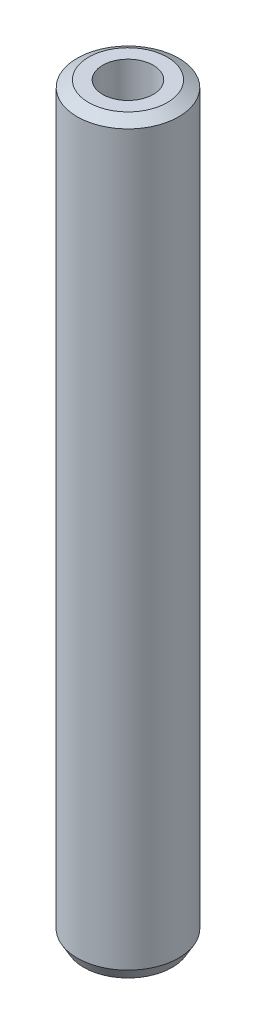
ISO-10303-21;
HEADER;
FILE_DESCRIPTION(('STEP AP214'),'2;1');
FILE_NAME('part.step','',(''),(''),'','','');
FILE_SCHEMA(('AUTOMOTIVE_DESIGN { 1 0 10303 214 1 1 1 1 }'));
ENDSEC;
DATA;
#1=APPLICATION_CONTEXT('core data for automotive mechanical design processes');
#2=APPLICATION_PROTOCOL_DEFINITION('international standard','automotive_design',2000,#1);
#3=PRODUCT_CONTEXT('',#1,'mechanical');
#4=PRODUCT('Part','Part','',(#3));
#5=PRODUCT_RELATED_PRODUCT_CATEGORY('part','',(#4));
#6=PRODUCT_DEFINITION_FORMATION('','',#4);
#7=PRODUCT_DEFINITION_CONTEXT('part definition',#1,'design');
#8=PRODUCT_DEFINITION('design','',#6,#7);
#9=PRODUCT_DEFINITION_SHAPE('','',#8);
#10=(LENGTH_UNIT() NAMED_UNIT(*) SI_UNIT(.MILLI.,.METRE.));
#11=(NAMED_UNIT(*) PLANE_ANGLE_UNIT() SI_UNIT($,.RADIAN.));
#12=(NAMED_UNIT(*) SI_UNIT($,.STERADIAN.) SOLID_ANGLE_UNIT());
#13=UNCERTAINTY_MEASURE_WITH_UNIT(LENGTH_MEASURE(1.E-05),#10,'distance_accuracy_value','');
#14=(GEOMETRIC_REPRESENTATION_CONTEXT(3) GLOBAL_UNCERTAINTY_ASSIGNED_CONTEXT((#13)) GLOBAL_UNIT_ASSIGNED_CONTEXT((#10,
#11,#12)) REPRESENTATION_CONTEXT('',''));
#15=CARTESIAN_POINT('',(0.,0.,0.));
#16=DIRECTION('',(0.,0.,1.));
#17=DIRECTION('',(1.,0.,0.));
#18=AXIS2_PLACEMENT_3D('',#15,#16,#17);
#19=CARTESIAN_POINT('',(0.,183.758441967485,0.));
#20=DIRECTION('',(0.,-1.,0.));
#21=DIRECTION('',(0.,0.,-1.));
#22=AXIS2_PLACEMENT_3D('',#19,#20,#21);
#23=CYLINDRICAL_SURFACE('',#22,12.5);
#24=CARTESIAN_POINT('',(0.,182.13114617367,0.));
#25=DIRECTION('',(0.,1.,0.));
#26=DIRECTION('',(0.,0.,1.));
#27=AXIS2_PLACEMENT_3D('',#24,#25,#26);
#28=CIRCLE('',#27,12.5);
#29=CARTESIAN_POINT('',(0.,182.13114617367,12.5));
#30=VERTEX_POINT('',#29);
#31=EDGE_CURVE('E50',#30,#30,#28,.F.);
#32=ORIENTED_EDGE('',*,*,#31,.T.);
#33=EDGE_LOOP('',(#32));
#34=FACE_BOUND('',#33,.T.);
#35=CARTESIAN_POINT('',(0.,2.81855899383082,0.));
#36=DIRECTION('',(0.,1.,0.));
#37=DIRECTION('',(0.,0.,1.));
#38=AXIS2_PLACEMENT_3D('',#35,#36,#37);
#39=CIRCLE('',#38,12.5);
#40=CARTESIAN_POINT('',(0.,2.81855899383082,12.5));
#41=VERTEX_POINT('',#40);
#42=EDGE_CURVE('E51',#41,#41,#39,.T.);
#43=ORIENTED_EDGE('',*,*,#42,.T.);
#44=EDGE_LOOP('',(#43));
#45=FACE_BOUND('',#44,.T.);
#46=ADVANCED_FACE('F39',(#34,#45),#23,.T.);
#47=CARTESIAN_POINT('',(0.,183.758441967485,0.));
#48=DIRECTION('',(0.,1.,0.));
#49=DIRECTION('',(0.,0.,1.));
#50=AXIS2_PLACEMENT_3D('',#47,#48,#49);
#51=PLANE('',#50);
#52=CARTESIAN_POINT('',(0.,183.758441967485,0.));
#53=DIRECTION('',(0.,1.,0.));
#54=DIRECTION('',(0.,0.,1.));
#55=AXIS2_PLACEMENT_3D('',#52,#53,#54);
#56=CIRCLE('',#55,9.68144100616913);
#57=CARTESIAN_POINT('',(0.,183.758441967485,9.68144100616913));
#58=VERTEX_POINT('',#57);
#59=EDGE_CURVE('E54',#58,#58,#56,.T.);
#60=ORIENTED_EDGE('',*,*,#59,.T.);
#61=EDGE_LOOP('',(#60));
#62=FACE_BOUND('',#61,.T.);
#63=CARTESIAN_POINT('',(0.,183.758441967485,0.));
#64=DIRECTION('',(0.,1.,0.));
#65=DIRECTION('',(0.,0.,1.));
#66=AXIS2_PLACEMENT_3D('',#63,#64,#65);
#67=CIRCLE('',#66,6.23207617805063);
#68=CARTESIAN_POINT('',(0.,183.758441967485,6.23207617805063));
#69=VERTEX_POINT('',#68);
#70=EDGE_CURVE('E58',#69,#69,#67,.T.);
#71=ORIENTED_EDGE('',*,*,#70,.F.);
#72=EDGE_LOOP('',(#71));
#73=FACE_BOUND('',#72,.T.);
#74=ADVANCED_FACE('F69',(#62,#73),#51,.T.);
#75=CARTESIAN_POINT('',(0.,0.,0.));
#76=DIRECTION('',(0.,1.,0.));
#77=DIRECTION('',(0.,0.,1.));
#78=AXIS2_PLACEMENT_3D('',#75,#76,#77);
#79=PLANE('',#78);
#80=CARTESIAN_POINT('',(0.,0.,0.));
#81=DIRECTION('',(0.,1.,0.));
#82=DIRECTION('',(0.,0.,1.));
#83=AXIS2_PLACEMENT_3D('',#80,#81,#82);
#84=CIRCLE('',#83,10.8727042061849);
#85=CARTESIAN_POINT('',(0.,0.,10.8727042061849));
#86=VERTEX_POINT('',#85);
#87=EDGE_CURVE('E10',#86,#86,#84,.F.);
#88=ORIENTED_EDGE('',*,*,#87,.T.);
#89=EDGE_LOOP('',(#88));
#90=FACE_BOUND('',#89,.T.);
#91=CARTESIAN_POINT('',(0.,0.,0.));
#92=DIRECTION('',(0.,1.,0.));
#93=DIRECTION('',(0.,0.,1.));
#94=AXIS2_PLACEMENT_3D('',#91,#92,#93);
#95=CIRCLE('',#94,6.23207617805063);
#96=CARTESIAN_POINT('',(0.,0.,6.23207617805063));
#97=VERTEX_POINT('',#96);
#98=EDGE_CURVE('E63',#97,#97,#95,.T.);
#99=ORIENTED_EDGE('',*,*,#98,.T.);
#100=EDGE_LOOP('',(#99));
#101=FACE_BOUND('',#100,.T.);
#102=ADVANCED_FACE('F75',(#90,#101),#79,.F.);
#103=CARTESIAN_POINT('',(0.,183.758441967485,0.));
#104=DIRECTION('',(0.,-1.,0.));
#105=DIRECTION('',(0.,0.,-1.));
#106=AXIS2_PLACEMENT_3D('',#103,#104,#105);
#107=CYLINDRICAL_SURFACE('',#106,6.23207617805063);
#108=ORIENTED_EDGE('',*,*,#70,.T.);
#109=EDGE_LOOP('',(#108));
#110=FACE_BOUND('',#109,.T.);
#111=ORIENTED_EDGE('',*,*,#98,.F.);
#112=EDGE_LOOP('',(#111));
#113=FACE_BOUND('',#112,.T.);
#114=ADVANCED_FACE('F70',(#110,#113),#107,.F.);
#115=CARTESIAN_POINT('',(0.,183.758441967485,0.));
#116=DIRECTION('',(0.,-1.,0.));
#117=DIRECTION('',(0.,0.,-1.));
#118=AXIS2_PLACEMENT_3D('',#115,#116,#117);
#119=CONICAL_SURFACE('',#118,9.68144100616913,1.0471975511966);
#120=ORIENTED_EDGE('',*,*,#31,.F.);
#121=EDGE_LOOP('',(#120));
#122=FACE_BOUND('',#121,.T.);
#123=ORIENTED_EDGE('',*,*,#59,.F.);
#124=EDGE_LOOP('',(#123));
#125=FACE_BOUND('',#124,.T.);
#126=ADVANCED_FACE('F81',(#122,#125),#119,.T.);
#127=CARTESIAN_POINT('',(0.,2.81855899383082,0.));
#128=DIRECTION('',(0.,1.,0.));
#129=DIRECTION('',(0.,0.,1.));
#130=AXIS2_PLACEMENT_3D('',#127,#128,#129);
#131=CONICAL_SURFACE('',#130,12.5,0.523598775598305);
#132=CARTESIAN_POINT('',(0.,0.,10.8727042061849));
#133=CARTESIAN_POINT('',(0.,0.0293599895190702,10.8896552040372));
#134=CARTESIAN_POINT('',(0.,0.0587199790381414,10.9066062018894));
#135=CARTESIAN_POINT('',(0.,0.117439958076284,10.9405081975939));
#136=CARTESIAN_POINT('',(0.,0.146799947595355,10.9574591954461));
#137=CARTESIAN_POINT('',(0.,0.205519926633497,10.9913611911506));
#138=CARTESIAN_POINT('',(0.,0.234879916152568,11.0083121890028));
#139=CARTESIAN_POINT('',(0.,0.29359989519071,11.0422141847073));
#140=CARTESIAN_POINT('',(0.,0.322959884709781,11.0591651825596));
#141=CARTESIAN_POINT('',(0.,0.381679863747923,11.093067178264));
#142=CARTESIAN_POINT('',(0.,0.411039853266994,11.1100181761163));
#143=CARTESIAN_POINT('',(0.,0.469759832305137,11.1439201718208));
#144=CARTESIAN_POINT('',(0.,0.499119821824208,11.160871169673));
#145=CARTESIAN_POINT('',(0.,0.55783980086235,11.1947731653775));
#146=CARTESIAN_POINT('',(0.,0.587199790381421,11.2117241632297));
#147=CARTESIAN_POINT('',(0.,0.645919769419563,11.2456261589342));
#148=CARTESIAN_POINT('',(0.,0.675279758938634,11.2625771567864));
#149=CARTESIAN_POINT('',(0.,0.733999737976776,11.2964791524909));
#150=CARTESIAN_POINT('',(0.,0.763359727495847,11.3134301503432));
#151=CARTESIAN_POINT('',(0.,0.822079706533989,11.3473321460476));
#152=CARTESIAN_POINT('',(0.,0.85143969605306,11.3642831438999));
#153=CARTESIAN_POINT('',(0.,0.910159675091202,11.3981851396044));
#154=CARTESIAN_POINT('',(0.,0.939519664610273,11.4151361374566));
#155=CARTESIAN_POINT('',(0.,0.998239643648416,11.4490381331611));
#156=CARTESIAN_POINT('',(0.,1.02759963316749,11.4659891310133));
#157=CARTESIAN_POINT('',(0.,1.08631961220563,11.4998911267178));
#158=CARTESIAN_POINT('',(0.,1.1156796017247,11.5168421245701));
#159=CARTESIAN_POINT('',(0.,1.17439958076284,11.5507441202745));
#160=CARTESIAN_POINT('',(0.,1.20375957028191,11.5676951181268));
#161=CARTESIAN_POINT('',(0.,1.26247954932006,11.6015971138313));
#162=CARTESIAN_POINT('',(0.,1.29183953883913,11.6185481116835));
#163=CARTESIAN_POINT('',(0.,1.35055951787727,11.652450107388));
#164=CARTESIAN_POINT('',(0.,1.37991950739634,11.6694011052402));
#165=CARTESIAN_POINT('',(0.,1.43863948643448,11.7033031009447));
#166=CARTESIAN_POINT('',(0.,1.46799947595355,11.7202540987969));
#167=CARTESIAN_POINT('',(0.,1.52671945499169,11.7541560945014));
#168=CARTESIAN_POINT('',(0.,1.55607944451077,11.7711070923537));
#169=CARTESIAN_POINT('',(0.,1.61479942354891,11.8050090880581));
#170=CARTESIAN_POINT('',(0.,1.64415941306798,11.8219600859104));
#171=CARTESIAN_POINT('',(0.,1.70287939210612,11.8558620816149));
#172=CARTESIAN_POINT('',(0.,1.73223938162519,11.8728130794671));
#173=CARTESIAN_POINT('',(0.,1.79095936066333,11.9067150751716));
#174=CARTESIAN_POINT('',(0.,1.82031935018241,11.9236660730238));
#175=CARTESIAN_POINT('',(0.,1.87903932922055,11.9575680687283));
#176=CARTESIAN_POINT('',(0.,1.90839931873962,11.9745190665805));
#177=CARTESIAN_POINT('',(0.,1.96711929777776,12.008421062285));
#178=CARTESIAN_POINT('',(0.,1.99647928729683,12.0253720601373));
#179=CARTESIAN_POINT('',(0.,2.05519926633497,12.0592740558417));
#180=CARTESIAN_POINT('',(0.,2.08455925585405,12.076225053694));
#181=CARTESIAN_POINT('',(0.,2.14327923489219,12.1101270493985));
#182=CARTESIAN_POINT('',(0.,2.17263922441126,12.1270780472507));
#183=CARTESIAN_POINT('',(0.,2.2313592034494,12.1609800429552));
#184=CARTESIAN_POINT('',(0.,2.26071919296847,12.1779310408074));
#185=CARTESIAN_POINT('',(0.,2.31943917200661,12.2118330365119));
#186=CARTESIAN_POINT('',(0.,2.34879916152568,12.2287840343642));
#187=CARTESIAN_POINT('',(0.,2.40751914056383,12.2626860300686));
#188=CARTESIAN_POINT('',(0.,2.4368791300829,12.2796370279209));
#189=CARTESIAN_POINT('',(0.,2.49559910912104,12.3135390236254));
#190=CARTESIAN_POINT('',(0.,2.52495909864011,12.3304900214776));
#191=CARTESIAN_POINT('',(0.,2.58367907767825,12.3643920171821));
#192=CARTESIAN_POINT('',(0.,2.61303906719732,12.3813430150343));
#193=CARTESIAN_POINT('',(0.,2.67175904623547,12.4152450107388));
#194=CARTESIAN_POINT('',(0.,2.70111903575454,12.432196008591));
#195=CARTESIAN_POINT('',(0.,2.75983901479268,12.4660980042955));
#196=CARTESIAN_POINT('',(0.,2.78919900431175,12.4830490021478));
#197=CARTESIAN_POINT('',(0.,2.81855899383082,12.5));
#198=B_SPLINE_CURVE_WITH_KNOTS('',3,(#132,#133,#134,#135,#136,#137,#138,#139,#140,#141,#142,
#143,#144,#145,#146,#147,#148,#149,#150,#151,#152,#153,#154,#155,#156,#157,#158,#159,#160,#161,
#162,#163,#164,#165,#166,#167,#168,#169,#170,#171,#172,#173,#174,#175,#176,#177,#178,#179,#180,
#181,#182,#183,#184,#185,#186,#187,#188,#189,#190,#191,#192,#193,#194,#195,#196,#197),
.UNSPECIFIED.,.F.,.F.,(4,2,2,2,2,2,2,2,2,2,2,2,2,2,2,2,2,2,2,2,2,2,2,2,2,2,2,2,2,2,2,2,4),(0.,
0.101705987113442,0.203411974226883,0.305117961340325,0.406823948453768,0.50852993556721,
0.610235922680652,0.711941909794094,0.813647896907535,0.915353884020977,1.01705987113442,
1.11876585824786,1.2204718453613,1.32217783247474,1.42388381958819,1.52558980670163,
1.62729579381507,1.72900178092851,1.83070776804195,1.9324137551554,2.03411974226884,
2.13582572938228,2.23753171649572,2.33923770360917,2.44094369072261,2.54264967783605,
2.64435566494949,2.74606165206293,2.84776763917638,2.94947362628982,3.05117961340326,
3.1528856005167,3.25459158763014),.UNSPECIFIED.);
#199=EDGE_CURVE('BSEAM45',#86,#41,#198,.T.);
#200=ORIENTED_EDGE('',*,*,#87,.F.);
#201=ORIENTED_EDGE('',*,*,#42,.F.);
#202=ORIENTED_EDGE('',*,*,#199,.T.);
#203=ORIENTED_EDGE('',*,*,#199,.F.);
#204=EDGE_LOOP('',(#200,#202,#201,#203));
#205=FACE_BOUND('',#204,.T.);
#206=ADVANCED_FACE('F45',(#205),#131,.T.);
#207=CLOSED_SHELL('',(#46,#74,#102,#114,#126,#206));
#208=MANIFOLD_SOLID_BREP('B2',#207);
#209=ADVANCED_BREP_SHAPE_REPRESENTATION('',(#18,#208),#14);
#210=SHAPE_DEFINITION_REPRESENTATION(#9,#209);
ENDSEC;
END-ISO-10303-21;
